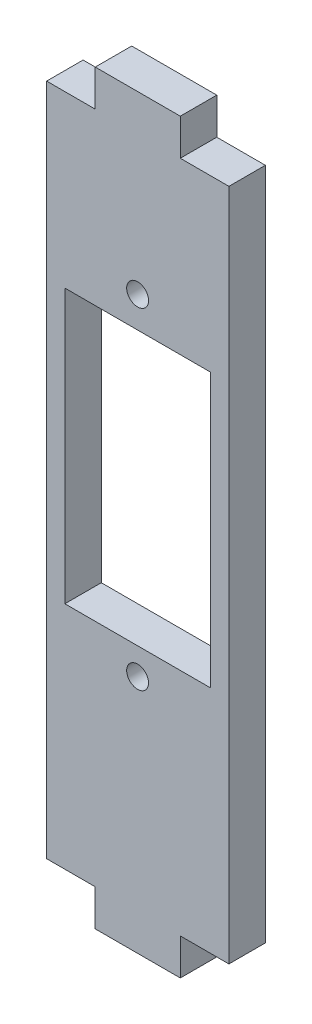
ISO-10303-21;
HEADER;
FILE_DESCRIPTION(('STEP AP214'),'2;1');
FILE_NAME('part.step','',(''),(''),'','','');
FILE_SCHEMA(('AUTOMOTIVE_DESIGN { 1 0 10303 214 1 1 1 1 }'));
ENDSEC;
DATA;
#1=APPLICATION_CONTEXT('core data for automotive mechanical design processes');
#2=APPLICATION_PROTOCOL_DEFINITION('international standard','automotive_design',2000,#1);
#3=PRODUCT_CONTEXT('',#1,'mechanical');
#4=PRODUCT('Part','Part','',(#3));
#5=PRODUCT_RELATED_PRODUCT_CATEGORY('part','',(#4));
#6=PRODUCT_DEFINITION_FORMATION('','',#4);
#7=PRODUCT_DEFINITION_CONTEXT('part definition',#1,'design');
#8=PRODUCT_DEFINITION('design','',#6,#7);
#9=PRODUCT_DEFINITION_SHAPE('','',#8);
#10=(LENGTH_UNIT() NAMED_UNIT(*) SI_UNIT(.MILLI.,.METRE.));
#11=(NAMED_UNIT(*) PLANE_ANGLE_UNIT() SI_UNIT($,.RADIAN.));
#12=(NAMED_UNIT(*) SI_UNIT($,.STERADIAN.) SOLID_ANGLE_UNIT());
#13=UNCERTAINTY_MEASURE_WITH_UNIT(LENGTH_MEASURE(1.E-05),#10,'distance_accuracy_value','');
#14=(GEOMETRIC_REPRESENTATION_CONTEXT(3) GLOBAL_UNCERTAINTY_ASSIGNED_CONTEXT((#13)) GLOBAL_UNIT_ASSIGNED_CONTEXT((#10,
#11,#12)) REPRESENTATION_CONTEXT('',''));
#15=CARTESIAN_POINT('',(0.,0.,0.));
#16=DIRECTION('',(0.,0.,1.));
#17=DIRECTION('',(1.,0.,0.));
#18=AXIS2_PLACEMENT_3D('',#15,#16,#17);
#19=CARTESIAN_POINT('',(0.,0.,3.));
#20=DIRECTION('',(0.,0.,1.));
#21=DIRECTION('',(1.,0.,0.));
#22=AXIS2_PLACEMENT_3D('',#19,#20,#21);
#23=PLANE('',#22);
#24=CARTESIAN_POINT('',(-0.0129135727040056,16.2550295868136,3.));
#25=DIRECTION('',(0.,0.,-1.));
#26=DIRECTION('',(-1.,0.,0.));
#27=AXIS2_PLACEMENT_3D('',#24,#25,#26);
#28=CIRCLE('',#27,0.900000000000001);
#29=CARTESIAN_POINT('',(-0.912913572704006,16.2550295868136,3.));
#30=VERTEX_POINT('',#29);
#31=EDGE_CURVE('E192',#30,#30,#28,.T.);
#32=ORIENTED_EDGE('',*,*,#31,.T.);
#33=EDGE_LOOP('',(#32));
#34=FACE_BOUND('',#33,.T.);
#35=CARTESIAN_POINT('',(-0.0129135727039986,-10.9949704131864,3.));
#36=DIRECTION('',(0.,0.,-1.));
#37=DIRECTION('',(-1.,0.,0.));
#38=AXIS2_PLACEMENT_3D('',#35,#36,#37);
#39=CIRCLE('',#38,0.9);
#40=CARTESIAN_POINT('',(-0.912913572703998,-10.9949704131864,3.));
#41=VERTEX_POINT('',#40);
#42=EDGE_CURVE('E556',#41,#41,#39,.T.);
#43=ORIENTED_EDGE('',*,*,#42,.T.);
#44=EDGE_LOOP('',(#43));
#45=FACE_BOUND('',#44,.T.);
#46=DIRECTION('',(0.,-1.,0.));
#47=VECTOR('',#46,1.);
#48=CARTESIAN_POINT('',(-6.,13.71,3.));
#49=LINE('',#48,#47);
#50=CARTESIAN_POINT('',(-6.,13.71,3.));
#51=VERTEX_POINT('',#50);
#52=CARTESIAN_POINT('',(-6.,-8.79000000000001,3.));
#53=VERTEX_POINT('',#52);
#54=EDGE_CURVE('E57',#51,#53,#49,.T.);
#55=ORIENTED_EDGE('',*,*,#54,.F.);
#56=DIRECTION('',(-1.,0.,0.));
#57=VECTOR('',#56,1.);
#58=CARTESIAN_POINT('',(-6.,13.71,3.));
#59=LINE('',#58,#57);
#60=CARTESIAN_POINT('',(6.,13.71,3.));
#61=VERTEX_POINT('',#60);
#62=EDGE_CURVE('E175',#61,#51,#59,.T.);
#63=ORIENTED_EDGE('',*,*,#62,.F.);
#64=DIRECTION('',(0.,1.,0.));
#65=VECTOR('',#64,1.);
#66=CARTESIAN_POINT('',(6.,13.71,3.));
#67=LINE('',#66,#65);
#68=CARTESIAN_POINT('',(6.,-8.79000000000001,3.));
#69=VERTEX_POINT('',#68);
#70=EDGE_CURVE('E179',#69,#61,#67,.T.);
#71=ORIENTED_EDGE('',*,*,#70,.F.);
#72=DIRECTION('',(1.,0.,0.));
#73=VECTOR('',#72,1.);
#74=CARTESIAN_POINT('',(-6.,-8.79000000000001,3.));
#75=LINE('',#74,#73);
#76=EDGE_CURVE('E191',#53,#69,#75,.T.);
#77=ORIENTED_EDGE('',*,*,#76,.F.);
#78=EDGE_LOOP('',(#55,#63,#71,#77));
#79=FACE_BOUND('',#78,.T.);
#80=DIRECTION('',(0.,-1.,0.));
#81=VECTOR('',#80,1.);
#82=CARTESIAN_POINT('',(-7.50000000000001,30.71,3.));
#83=LINE('',#82,#81);
#84=CARTESIAN_POINT('',(-7.50000000000001,27.71,3.));
#85=VERTEX_POINT('',#84);
#86=CARTESIAN_POINT('',(-7.50000000000001,-27.71,3.));
#87=VERTEX_POINT('',#86);
#88=EDGE_CURVE('E49',#85,#87,#83,.T.);
#89=ORIENTED_EDGE('',*,*,#88,.T.);
#90=DIRECTION('',(1.,0.,0.));
#91=VECTOR('',#90,1.);
#92=CARTESIAN_POINT('',(-7.50000000000001,-27.71,3.));
#93=LINE('',#92,#91);
#94=CARTESIAN_POINT('',(-3.5,-27.71,3.));
#95=VERTEX_POINT('',#94);
#96=EDGE_CURVE('E211',#87,#95,#93,.T.);
#97=ORIENTED_EDGE('',*,*,#96,.T.);
#98=DIRECTION('',(0.,-1.,0.));
#99=VECTOR('',#98,1.);
#100=CARTESIAN_POINT('',(-3.5,-30.71,3.));
#101=LINE('',#100,#99);
#102=CARTESIAN_POINT('',(-3.5,-30.71,3.));
#103=VERTEX_POINT('',#102);
#104=EDGE_CURVE('E201',#95,#103,#101,.T.);
#105=ORIENTED_EDGE('',*,*,#104,.T.);
#106=DIRECTION('',(1.,0.,0.));
#107=VECTOR('',#106,1.);
#108=CARTESIAN_POINT('',(-7.5,-30.71,3.));
#109=LINE('',#108,#107);
#110=CARTESIAN_POINT('',(3.5,-30.71,3.));
#111=VERTEX_POINT('',#110);
#112=EDGE_CURVE('E11',#103,#111,#109,.T.);
#113=ORIENTED_EDGE('',*,*,#112,.T.);
#114=DIRECTION('',(0.,-1.,0.));
#115=VECTOR('',#114,1.);
#116=CARTESIAN_POINT('',(3.5,-30.71,3.));
#117=LINE('',#116,#115);
#118=CARTESIAN_POINT('',(3.5,-27.71,3.));
#119=VERTEX_POINT('',#118);
#120=EDGE_CURVE('E236',#119,#111,#117,.T.);
#121=ORIENTED_EDGE('',*,*,#120,.F.);
#122=DIRECTION('',(-1.,0.,0.));
#123=VECTOR('',#122,1.);
#124=CARTESIAN_POINT('',(7.50000000000001,-27.71,3.));
#125=LINE('',#124,#123);
#126=CARTESIAN_POINT('',(7.50000000000001,-27.71,3.));
#127=VERTEX_POINT('',#126);
#128=EDGE_CURVE('E225',#127,#119,#125,.T.);
#129=ORIENTED_EDGE('',*,*,#128,.F.);
#130=DIRECTION('',(0.,1.,0.));
#131=VECTOR('',#130,1.);
#132=CARTESIAN_POINT('',(7.49999999999999,30.71,3.));
#133=LINE('',#132,#131);
#134=CARTESIAN_POINT('',(7.50000000000001,27.71,3.));
#135=VERTEX_POINT('',#134);
#136=EDGE_CURVE('E308',#127,#135,#133,.T.);
#137=ORIENTED_EDGE('',*,*,#136,.T.);
#138=DIRECTION('',(-1.,0.,0.));
#139=VECTOR('',#138,1.);
#140=CARTESIAN_POINT('',(7.50000000000001,27.71,3.));
#141=LINE('',#140,#139);
#142=CARTESIAN_POINT('',(3.5,27.71,3.));
#143=VERTEX_POINT('',#142);
#144=EDGE_CURVE('E261',#135,#143,#141,.T.);
#145=ORIENTED_EDGE('',*,*,#144,.T.);
#146=DIRECTION('',(0.,1.,0.));
#147=VECTOR('',#146,1.);
#148=CARTESIAN_POINT('',(3.5,30.71,3.));
#149=LINE('',#148,#147);
#150=CARTESIAN_POINT('',(3.5,30.71,3.));
#151=VERTEX_POINT('',#150);
#152=EDGE_CURVE('E251',#143,#151,#149,.T.);
#153=ORIENTED_EDGE('',*,*,#152,.T.);
#154=DIRECTION('',(-1.,0.,0.));
#155=VECTOR('',#154,1.);
#156=CARTESIAN_POINT('',(-7.50000000000001,30.71,3.));
#157=LINE('',#156,#155);
#158=CARTESIAN_POINT('',(-3.5,30.71,3.));
#159=VERTEX_POINT('',#158);
#160=EDGE_CURVE('E311',#151,#159,#157,.T.);
#161=ORIENTED_EDGE('',*,*,#160,.T.);
#162=DIRECTION('',(0.,1.,0.));
#163=VECTOR('',#162,1.);
#164=CARTESIAN_POINT('',(-3.5,30.71,3.));
#165=LINE('',#164,#163);
#166=CARTESIAN_POINT('',(-3.5,27.71,3.));
#167=VERTEX_POINT('',#166);
#168=EDGE_CURVE('E287',#167,#159,#165,.T.);
#169=ORIENTED_EDGE('',*,*,#168,.F.);
#170=DIRECTION('',(1.,0.,0.));
#171=VECTOR('',#170,1.);
#172=CARTESIAN_POINT('',(-7.50000000000001,27.71,3.));
#173=LINE('',#172,#171);
#174=EDGE_CURVE('E276',#85,#167,#173,.T.);
#175=ORIENTED_EDGE('',*,*,#174,.F.);
#176=EDGE_LOOP('',(#89,#97,#105,#113,#121,#129,#137,#145,#153,#161,#169,#175));
#177=FACE_BOUND('',#176,.T.);
#178=ADVANCED_FACE('F39',(#34,#45,#79,#177),#23,.T.);
#179=CARTESIAN_POINT('',(0.,0.,0.));
#180=DIRECTION('',(0.,0.,1.));
#181=DIRECTION('',(1.,0.,0.));
#182=AXIS2_PLACEMENT_3D('',#179,#180,#181);
#183=PLANE('',#182);
#184=CARTESIAN_POINT('',(-0.0129135727040056,16.2550295868136,0.));
#185=DIRECTION('',(0.,0.,-1.));
#186=DIRECTION('',(-1.,0.,0.));
#187=AXIS2_PLACEMENT_3D('',#184,#185,#186);
#188=CIRCLE('',#187,0.900000000000001);
#189=CARTESIAN_POINT('',(-0.912913572704006,16.2550295868136,0.));
#190=VERTEX_POINT('',#189);
#191=EDGE_CURVE('E554',#190,#190,#188,.T.);
#192=ORIENTED_EDGE('',*,*,#191,.F.);
#193=EDGE_LOOP('',(#192));
#194=FACE_BOUND('',#193,.T.);
#195=CARTESIAN_POINT('',(-0.0129135727039986,-10.9949704131864,0.));
#196=DIRECTION('',(0.,0.,-1.));
#197=DIRECTION('',(-1.,0.,0.));
#198=AXIS2_PLACEMENT_3D('',#195,#196,#197);
#199=CIRCLE('',#198,0.9);
#200=CARTESIAN_POINT('',(-0.912913572703998,-10.9949704131864,0.));
#201=VERTEX_POINT('',#200);
#202=EDGE_CURVE('E182',#201,#201,#199,.T.);
#203=ORIENTED_EDGE('',*,*,#202,.F.);
#204=EDGE_LOOP('',(#203));
#205=FACE_BOUND('',#204,.T.);
#206=DIRECTION('',(-1.,0.,0.));
#207=VECTOR('',#206,1.);
#208=CARTESIAN_POINT('',(-6.,13.71,0.));
#209=LINE('',#208,#207);
#210=CARTESIAN_POINT('',(6.,13.71,0.));
#211=VERTEX_POINT('',#210);
#212=CARTESIAN_POINT('',(-6.,13.71,0.));
#213=VERTEX_POINT('',#212);
#214=EDGE_CURVE('E163',#211,#213,#209,.T.);
#215=ORIENTED_EDGE('',*,*,#214,.T.);
#216=DIRECTION('',(0.,-1.,0.));
#217=VECTOR('',#216,1.);
#218=CARTESIAN_POINT('',(-6.,13.71,0.));
#219=LINE('',#218,#217);
#220=CARTESIAN_POINT('',(-6.,-8.79000000000001,0.));
#221=VERTEX_POINT('',#220);
#222=EDGE_CURVE('E156',#213,#221,#219,.T.);
#223=ORIENTED_EDGE('',*,*,#222,.T.);
#224=DIRECTION('',(1.,0.,0.));
#225=VECTOR('',#224,1.);
#226=CARTESIAN_POINT('',(-6.,-8.79000000000001,0.));
#227=LINE('',#226,#225);
#228=CARTESIAN_POINT('',(6.,-8.79000000000001,0.));
#229=VERTEX_POINT('',#228);
#230=EDGE_CURVE('E166',#221,#229,#227,.T.);
#231=ORIENTED_EDGE('',*,*,#230,.T.);
#232=DIRECTION('',(0.,1.,0.));
#233=VECTOR('',#232,1.);
#234=CARTESIAN_POINT('',(6.,13.71,0.));
#235=LINE('',#234,#233);
#236=EDGE_CURVE('E65',#229,#211,#235,.T.);
#237=ORIENTED_EDGE('',*,*,#236,.T.);
#238=EDGE_LOOP('',(#215,#223,#231,#237));
#239=FACE_BOUND('',#238,.T.);
#240=DIRECTION('',(1.,0.,0.));
#241=VECTOR('',#240,1.);
#242=CARTESIAN_POINT('',(-7.50000000000001,-27.71,0.));
#243=LINE('',#242,#241);
#244=CARTESIAN_POINT('',(-7.50000000000001,-27.71,0.));
#245=VERTEX_POINT('',#244);
#246=CARTESIAN_POINT('',(-3.5,-27.71,0.));
#247=VERTEX_POINT('',#246);
#248=EDGE_CURVE('E210',#245,#247,#243,.T.);
#249=ORIENTED_EDGE('',*,*,#248,.F.);
#250=DIRECTION('',(0.,-1.,0.));
#251=VECTOR('',#250,1.);
#252=CARTESIAN_POINT('',(-7.50000000000001,30.71,0.));
#253=LINE('',#252,#251);
#254=CARTESIAN_POINT('',(-7.50000000000001,27.71,0.));
#255=VERTEX_POINT('',#254);
#256=EDGE_CURVE('E321',#255,#245,#253,.T.);
#257=ORIENTED_EDGE('',*,*,#256,.F.);
#258=DIRECTION('',(1.,0.,0.));
#259=VECTOR('',#258,1.);
#260=CARTESIAN_POINT('',(-7.50000000000001,27.71,0.));
#261=LINE('',#260,#259);
#262=CARTESIAN_POINT('',(-3.5,27.71,0.));
#263=VERTEX_POINT('',#262);
#264=EDGE_CURVE('E282',#255,#263,#261,.T.);
#265=ORIENTED_EDGE('',*,*,#264,.T.);
#266=DIRECTION('',(0.,1.,0.));
#267=VECTOR('',#266,1.);
#268=CARTESIAN_POINT('',(-3.5,30.71,0.));
#269=LINE('',#268,#267);
#270=CARTESIAN_POINT('',(-3.5,30.71,0.));
#271=VERTEX_POINT('',#270);
#272=EDGE_CURVE('E286',#263,#271,#269,.T.);
#273=ORIENTED_EDGE('',*,*,#272,.T.);
#274=DIRECTION('',(-1.,0.,0.));
#275=VECTOR('',#274,1.);
#276=CARTESIAN_POINT('',(-7.50000000000001,30.71,0.));
#277=LINE('',#276,#275);
#278=CARTESIAN_POINT('',(3.5,30.71,0.));
#279=VERTEX_POINT('',#278);
#280=EDGE_CURVE('E319',#279,#271,#277,.T.);
#281=ORIENTED_EDGE('',*,*,#280,.F.);
#282=DIRECTION('',(0.,1.,0.));
#283=VECTOR('',#282,1.);
#284=CARTESIAN_POINT('',(3.5,30.71,0.));
#285=LINE('',#284,#283);
#286=CARTESIAN_POINT('',(3.5,27.71,0.));
#287=VERTEX_POINT('',#286);
#288=EDGE_CURVE('E257',#287,#279,#285,.T.);
#289=ORIENTED_EDGE('',*,*,#288,.F.);
#290=DIRECTION('',(-1.,0.,0.));
#291=VECTOR('',#290,1.);
#292=CARTESIAN_POINT('',(7.50000000000001,27.71,0.));
#293=LINE('',#292,#291);
#294=CARTESIAN_POINT('',(7.50000000000001,27.71,0.));
#295=VERTEX_POINT('',#294);
#296=EDGE_CURVE('E260',#295,#287,#293,.T.);
#297=ORIENTED_EDGE('',*,*,#296,.F.);
#298=DIRECTION('',(0.,1.,0.));
#299=VECTOR('',#298,1.);
#300=CARTESIAN_POINT('',(7.49999999999999,30.71,0.));
#301=LINE('',#300,#299);
#302=CARTESIAN_POINT('',(7.50000000000001,-27.71,0.));
#303=VERTEX_POINT('',#302);
#304=EDGE_CURVE('E302',#303,#295,#301,.T.);
#305=ORIENTED_EDGE('',*,*,#304,.F.);
#306=DIRECTION('',(-1.,0.,0.));
#307=VECTOR('',#306,1.);
#308=CARTESIAN_POINT('',(7.50000000000001,-27.71,0.));
#309=LINE('',#308,#307);
#310=CARTESIAN_POINT('',(3.5,-27.71,0.));
#311=VERTEX_POINT('',#310);
#312=EDGE_CURVE('E231',#303,#311,#309,.T.);
#313=ORIENTED_EDGE('',*,*,#312,.T.);
#314=DIRECTION('',(0.,-1.,0.));
#315=VECTOR('',#314,1.);
#316=CARTESIAN_POINT('',(3.5,-30.71,0.));
#317=LINE('',#316,#315);
#318=CARTESIAN_POINT('',(3.5,-30.71,0.));
#319=VERTEX_POINT('',#318);
#320=EDGE_CURVE('E235',#311,#319,#317,.T.);
#321=ORIENTED_EDGE('',*,*,#320,.T.);
#322=DIRECTION('',(1.,0.,0.));
#323=VECTOR('',#322,1.);
#324=CARTESIAN_POINT('',(-7.5,-30.71,0.));
#325=LINE('',#324,#323);
#326=CARTESIAN_POINT('',(-3.5,-30.71,0.));
#327=VERTEX_POINT('',#326);
#328=EDGE_CURVE('E43',#327,#319,#325,.T.);
#329=ORIENTED_EDGE('',*,*,#328,.F.);
#330=DIRECTION('',(0.,-1.,0.));
#331=VECTOR('',#330,1.);
#332=CARTESIAN_POINT('',(-3.5,-30.71,0.));
#333=LINE('',#332,#331);
#334=EDGE_CURVE('E207',#247,#327,#333,.T.);
#335=ORIENTED_EDGE('',*,*,#334,.F.);
#336=EDGE_LOOP('',(#249,#257,#265,#273,#281,#289,#297,#305,#313,#321,#329,#335));
#337=FACE_BOUND('',#336,.T.);
#338=ADVANCED_FACE('F171',(#194,#205,#239,#337),#183,.F.);
#339=CARTESIAN_POINT('',(-7.50000000000001,30.71,3.));
#340=DIRECTION('',(1.,0.,0.));
#341=DIRECTION('',(0.,1.,0.));
#342=AXIS2_PLACEMENT_3D('',#339,#340,#341);
#343=PLANE('',#342);
#344=DIRECTION('',(0.,0.,1.));
#345=VECTOR('',#344,1.);
#346=CARTESIAN_POINT('',(-7.50000000000001,-27.71,0.));
#347=LINE('',#346,#345);
#348=EDGE_CURVE('E221',#245,#87,#347,.T.);
#349=ORIENTED_EDGE('',*,*,#348,.T.);
#350=ORIENTED_EDGE('',*,*,#88,.F.);
#351=DIRECTION('',(0.,0.,1.));
#352=VECTOR('',#351,1.);
#353=CARTESIAN_POINT('',(-7.50000000000001,27.71,0.));
#354=LINE('',#353,#352);
#355=EDGE_CURVE('E291',#255,#85,#354,.T.);
#356=ORIENTED_EDGE('',*,*,#355,.F.);
#357=ORIENTED_EDGE('',*,*,#256,.T.);
#358=EDGE_LOOP('',(#349,#350,#356,#357));
#359=FACE_BOUND('',#358,.T.);
#360=ADVANCED_FACE('F371',(#359),#343,.F.);
#361=CARTESIAN_POINT('',(-7.5,-30.71,3.));
#362=DIRECTION('',(0.,1.,0.));
#363=DIRECTION('',(0.,0.,1.));
#364=AXIS2_PLACEMENT_3D('',#361,#362,#363);
#365=PLANE('',#364);
#366=DIRECTION('',(0.,0.,1.));
#367=VECTOR('',#366,1.);
#368=CARTESIAN_POINT('',(-3.5,-30.71,0.));
#369=LINE('',#368,#367);
#370=EDGE_CURVE('E214',#327,#103,#369,.T.);
#371=ORIENTED_EDGE('',*,*,#370,.F.);
#372=ORIENTED_EDGE('',*,*,#328,.T.);
#373=DIRECTION('',(0.,0.,1.));
#374=VECTOR('',#373,1.);
#375=CARTESIAN_POINT('',(3.5,-30.71,0.));
#376=LINE('',#375,#374);
#377=EDGE_CURVE('E247',#319,#111,#376,.T.);
#378=ORIENTED_EDGE('',*,*,#377,.T.);
#379=ORIENTED_EDGE('',*,*,#112,.F.);
#380=EDGE_LOOP('',(#371,#372,#378,#379));
#381=FACE_BOUND('',#380,.T.);
#382=ADVANCED_FACE('F332',(#381),#365,.F.);
#383=CARTESIAN_POINT('',(7.49999999999999,30.71,3.));
#384=DIRECTION('',(-1.,0.,0.));
#385=DIRECTION('',(0.,-1.,0.));
#386=AXIS2_PLACEMENT_3D('',#383,#384,#385);
#387=PLANE('',#386);
#388=ORIENTED_EDGE('',*,*,#136,.F.);
#389=DIRECTION('',(0.,0.,1.));
#390=VECTOR('',#389,1.);
#391=CARTESIAN_POINT('',(7.50000000000001,-27.71,0.));
#392=LINE('',#391,#390);
#393=EDGE_CURVE('E240',#303,#127,#392,.T.);
#394=ORIENTED_EDGE('',*,*,#393,.F.);
#395=ORIENTED_EDGE('',*,*,#304,.T.);
#396=DIRECTION('',(0.,0.,1.));
#397=VECTOR('',#396,1.);
#398=CARTESIAN_POINT('',(7.50000000000001,27.71,0.));
#399=LINE('',#398,#397);
#400=EDGE_CURVE('E272',#295,#135,#399,.T.);
#401=ORIENTED_EDGE('',*,*,#400,.T.);
#402=EDGE_LOOP('',(#388,#394,#395,#401));
#403=FACE_BOUND('',#402,.T.);
#404=ADVANCED_FACE('F41',(#403),#387,.F.);
#405=CARTESIAN_POINT('',(-7.50000000000001,30.71,3.));
#406=DIRECTION('',(0.,-1.,0.));
#407=DIRECTION('',(0.,0.,-1.));
#408=AXIS2_PLACEMENT_3D('',#405,#406,#407);
#409=PLANE('',#408);
#410=DIRECTION('',(0.,0.,1.));
#411=VECTOR('',#410,1.);
#412=CARTESIAN_POINT('',(3.5,30.71,0.));
#413=LINE('',#412,#411);
#414=EDGE_CURVE('E265',#279,#151,#413,.T.);
#415=ORIENTED_EDGE('',*,*,#414,.F.);
#416=ORIENTED_EDGE('',*,*,#280,.T.);
#417=DIRECTION('',(0.,0.,1.));
#418=VECTOR('',#417,1.);
#419=CARTESIAN_POINT('',(-3.5,30.71,0.));
#420=LINE('',#419,#418);
#421=EDGE_CURVE('E298',#271,#159,#420,.T.);
#422=ORIENTED_EDGE('',*,*,#421,.T.);
#423=ORIENTED_EDGE('',*,*,#160,.F.);
#424=EDGE_LOOP('',(#415,#416,#422,#423));
#425=FACE_BOUND('',#424,.T.);
#426=ADVANCED_FACE('F361',(#425),#409,.F.);
#427=CARTESIAN_POINT('',(-3.5,30.71,0.));
#428=DIRECTION('',(1.,0.,0.));
#429=DIRECTION('',(0.,1.,0.));
#430=AXIS2_PLACEMENT_3D('',#427,#428,#429);
#431=PLANE('',#430);
#432=ORIENTED_EDGE('',*,*,#168,.T.);
#433=ORIENTED_EDGE('',*,*,#421,.F.);
#434=ORIENTED_EDGE('',*,*,#272,.F.);
#435=DIRECTION('',(0.,0.,1.));
#436=VECTOR('',#435,1.);
#437=CARTESIAN_POINT('',(-3.5,27.71,0.));
#438=LINE('',#437,#436);
#439=EDGE_CURVE('E303',#263,#167,#438,.T.);
#440=ORIENTED_EDGE('',*,*,#439,.T.);
#441=EDGE_LOOP('',(#432,#433,#434,#440));
#442=FACE_BOUND('',#441,.T.);
#443=ADVANCED_FACE('F365',(#442),#431,.F.);
#444=CARTESIAN_POINT('',(-7.50000000000001,27.71,0.));
#445=DIRECTION('',(0.,-1.,0.));
#446=DIRECTION('',(0.,0.,-1.));
#447=AXIS2_PLACEMENT_3D('',#444,#445,#446);
#448=PLANE('',#447);
#449=ORIENTED_EDGE('',*,*,#174,.T.);
#450=ORIENTED_EDGE('',*,*,#439,.F.);
#451=ORIENTED_EDGE('',*,*,#264,.F.);
#452=ORIENTED_EDGE('',*,*,#355,.T.);
#453=EDGE_LOOP('',(#449,#450,#451,#452));
#454=FACE_BOUND('',#453,.T.);
#455=ADVANCED_FACE('F368',(#454),#448,.F.);
#456=CARTESIAN_POINT('',(7.50000000000001,27.71,0.));
#457=DIRECTION('',(0.,1.,0.));
#458=DIRECTION('',(0.,0.,1.));
#459=AXIS2_PLACEMENT_3D('',#456,#457,#458);
#460=PLANE('',#459);
#461=ORIENTED_EDGE('',*,*,#144,.F.);
#462=ORIENTED_EDGE('',*,*,#400,.F.);
#463=ORIENTED_EDGE('',*,*,#296,.T.);
#464=DIRECTION('',(0.,0.,1.));
#465=VECTOR('',#464,1.);
#466=CARTESIAN_POINT('',(3.5,27.71,0.));
#467=LINE('',#466,#465);
#468=EDGE_CURVE('E277',#287,#143,#467,.T.);
#469=ORIENTED_EDGE('',*,*,#468,.T.);
#470=EDGE_LOOP('',(#461,#462,#463,#469));
#471=FACE_BOUND('',#470,.T.);
#472=ADVANCED_FACE('F352',(#471),#460,.T.);
#473=CARTESIAN_POINT('',(3.5,30.71,0.));
#474=DIRECTION('',(1.,0.,0.));
#475=DIRECTION('',(0.,1.,0.));
#476=AXIS2_PLACEMENT_3D('',#473,#474,#475);
#477=PLANE('',#476);
#478=ORIENTED_EDGE('',*,*,#152,.F.);
#479=ORIENTED_EDGE('',*,*,#468,.F.);
#480=ORIENTED_EDGE('',*,*,#288,.T.);
#481=ORIENTED_EDGE('',*,*,#414,.T.);
#482=EDGE_LOOP('',(#478,#479,#480,#481));
#483=FACE_BOUND('',#482,.T.);
#484=ADVANCED_FACE('F356',(#483),#477,.T.);
#485=CARTESIAN_POINT('',(3.5,-30.71,0.));
#486=DIRECTION('',(-1.,0.,0.));
#487=DIRECTION('',(0.,-1.,0.));
#488=AXIS2_PLACEMENT_3D('',#485,#486,#487);
#489=PLANE('',#488);
#490=ORIENTED_EDGE('',*,*,#120,.T.);
#491=ORIENTED_EDGE('',*,*,#377,.F.);
#492=ORIENTED_EDGE('',*,*,#320,.F.);
#493=DIRECTION('',(0.,0.,1.));
#494=VECTOR('',#493,1.);
#495=CARTESIAN_POINT('',(3.5,-27.71,0.));
#496=LINE('',#495,#494);
#497=EDGE_CURVE('E252',#311,#119,#496,.T.);
#498=ORIENTED_EDGE('',*,*,#497,.T.);
#499=EDGE_LOOP('',(#490,#491,#492,#498));
#500=FACE_BOUND('',#499,.T.);
#501=ADVANCED_FACE('F337',(#500),#489,.F.);
#502=CARTESIAN_POINT('',(7.50000000000001,-27.71,0.));
#503=DIRECTION('',(0.,1.,0.));
#504=DIRECTION('',(0.,0.,1.));
#505=AXIS2_PLACEMENT_3D('',#502,#503,#504);
#506=PLANE('',#505);
#507=ORIENTED_EDGE('',*,*,#128,.T.);
#508=ORIENTED_EDGE('',*,*,#497,.F.);
#509=ORIENTED_EDGE('',*,*,#312,.F.);
#510=ORIENTED_EDGE('',*,*,#393,.T.);
#511=EDGE_LOOP('',(#507,#508,#509,#510));
#512=FACE_BOUND('',#511,.T.);
#513=ADVANCED_FACE('F344',(#512),#506,.F.);
#514=CARTESIAN_POINT('',(-7.50000000000001,-27.71,0.));
#515=DIRECTION('',(0.,-1.,0.));
#516=DIRECTION('',(0.,0.,-1.));
#517=AXIS2_PLACEMENT_3D('',#514,#515,#516);
#518=PLANE('',#517);
#519=ORIENTED_EDGE('',*,*,#96,.F.);
#520=ORIENTED_EDGE('',*,*,#348,.F.);
#521=ORIENTED_EDGE('',*,*,#248,.T.);
#522=DIRECTION('',(0.,0.,1.));
#523=VECTOR('',#522,1.);
#524=CARTESIAN_POINT('',(-3.5,-27.71,0.));
#525=LINE('',#524,#523);
#526=EDGE_CURVE('E226',#247,#95,#525,.T.);
#527=ORIENTED_EDGE('',*,*,#526,.T.);
#528=EDGE_LOOP('',(#519,#520,#521,#527));
#529=FACE_BOUND('',#528,.T.);
#530=ADVANCED_FACE('F374',(#529),#518,.T.);
#531=CARTESIAN_POINT('',(-3.5,-30.71,0.));
#532=DIRECTION('',(-1.,0.,0.));
#533=DIRECTION('',(0.,-1.,0.));
#534=AXIS2_PLACEMENT_3D('',#531,#532,#533);
#535=PLANE('',#534);
#536=ORIENTED_EDGE('',*,*,#104,.F.);
#537=ORIENTED_EDGE('',*,*,#526,.F.);
#538=ORIENTED_EDGE('',*,*,#334,.T.);
#539=ORIENTED_EDGE('',*,*,#370,.T.);
#540=EDGE_LOOP('',(#536,#537,#538,#539));
#541=FACE_BOUND('',#540,.T.);
#542=ADVANCED_FACE('F377',(#541),#535,.T.);
#543=CARTESIAN_POINT('',(-6.,13.71,0.));
#544=DIRECTION('',(-1.,0.,0.));
#545=DIRECTION('',(0.,-1.,0.));
#546=AXIS2_PLACEMENT_3D('',#543,#544,#545);
#547=PLANE('',#546);
#548=ORIENTED_EDGE('',*,*,#54,.T.);
#549=DIRECTION('',(0.,0.,1.));
#550=VECTOR('',#549,1.);
#551=CARTESIAN_POINT('',(-6.,-8.79000000000001,0.));
#552=LINE('',#551,#550);
#553=EDGE_CURVE('E152',#221,#53,#552,.T.);
#554=ORIENTED_EDGE('',*,*,#553,.F.);
#555=ORIENTED_EDGE('',*,*,#222,.F.);
#556=DIRECTION('',(0.,0.,1.));
#557=VECTOR('',#556,1.);
#558=CARTESIAN_POINT('',(-6.,13.71,0.));
#559=LINE('',#558,#557);
#560=EDGE_CURVE('E198',#213,#51,#559,.T.);
#561=ORIENTED_EDGE('',*,*,#560,.T.);
#562=EDGE_LOOP('',(#548,#554,#555,#561));
#563=FACE_BOUND('',#562,.T.);
#564=ADVANCED_FACE('F154',(#563),#547,.F.);
#565=CARTESIAN_POINT('',(-6.,13.71,0.));
#566=DIRECTION('',(0.,1.,0.));
#567=DIRECTION('',(0.,0.,1.));
#568=AXIS2_PLACEMENT_3D('',#565,#566,#567);
#569=PLANE('',#568);
#570=ORIENTED_EDGE('',*,*,#62,.T.);
#571=ORIENTED_EDGE('',*,*,#560,.F.);
#572=ORIENTED_EDGE('',*,*,#214,.F.);
#573=DIRECTION('',(0.,0.,1.));
#574=VECTOR('',#573,1.);
#575=CARTESIAN_POINT('',(6.,13.71,0.));
#576=LINE('',#575,#574);
#577=EDGE_CURVE('E202',#211,#61,#576,.T.);
#578=ORIENTED_EDGE('',*,*,#577,.T.);
#579=EDGE_LOOP('',(#570,#571,#572,#578));
#580=FACE_BOUND('',#579,.T.);
#581=ADVANCED_FACE('F384',(#580),#569,.F.);
#582=CARTESIAN_POINT('',(6.,13.71,0.));
#583=DIRECTION('',(1.,0.,0.));
#584=DIRECTION('',(0.,1.,0.));
#585=AXIS2_PLACEMENT_3D('',#582,#583,#584);
#586=PLANE('',#585);
#587=ORIENTED_EDGE('',*,*,#70,.T.);
#588=ORIENTED_EDGE('',*,*,#577,.F.);
#589=ORIENTED_EDGE('',*,*,#236,.F.);
#590=DIRECTION('',(0.,0.,1.));
#591=VECTOR('',#590,1.);
#592=CARTESIAN_POINT('',(6.,-8.79000000000001,0.));
#593=LINE('',#592,#591);
#594=EDGE_CURVE('E162',#229,#69,#593,.T.);
#595=ORIENTED_EDGE('',*,*,#594,.T.);
#596=EDGE_LOOP('',(#587,#588,#589,#595));
#597=FACE_BOUND('',#596,.T.);
#598=ADVANCED_FACE('F459',(#597),#586,.F.);
#599=CARTESIAN_POINT('',(-6.,-8.79000000000001,0.));
#600=DIRECTION('',(0.,-1.,0.));
#601=DIRECTION('',(0.,0.,-1.));
#602=AXIS2_PLACEMENT_3D('',#599,#600,#601);
#603=PLANE('',#602);
#604=ORIENTED_EDGE('',*,*,#76,.T.);
#605=ORIENTED_EDGE('',*,*,#594,.F.);
#606=ORIENTED_EDGE('',*,*,#230,.F.);
#607=ORIENTED_EDGE('',*,*,#553,.T.);
#608=EDGE_LOOP('',(#604,#605,#606,#607));
#609=FACE_BOUND('',#608,.T.);
#610=ADVANCED_FACE('F167',(#609),#603,.F.);
#611=CARTESIAN_POINT('',(-0.0129135727039986,-10.9949704131864,3.));
#612=DIRECTION('',(0.,0.,-1.));
#613=DIRECTION('',(-1.,0.,0.));
#614=AXIS2_PLACEMENT_3D('',#611,#612,#613);
#615=CYLINDRICAL_SURFACE('',#614,0.9);
#616=ORIENTED_EDGE('',*,*,#42,.F.);
#617=EDGE_LOOP('',(#616));
#618=FACE_BOUND('',#617,.T.);
#619=ORIENTED_EDGE('',*,*,#202,.T.);
#620=EDGE_LOOP('',(#619));
#621=FACE_BOUND('',#620,.T.);
#622=ADVANCED_FACE('F433',(#618,#621),#615,.F.);
#623=CARTESIAN_POINT('',(-0.0129135727040056,16.2550295868136,3.));
#624=DIRECTION('',(0.,0.,-1.));
#625=DIRECTION('',(-1.,0.,0.));
#626=AXIS2_PLACEMENT_3D('',#623,#624,#625);
#627=CYLINDRICAL_SURFACE('',#626,0.900000000000001);
#628=ORIENTED_EDGE('',*,*,#31,.F.);
#629=EDGE_LOOP('',(#628));
#630=FACE_BOUND('',#629,.T.);
#631=ORIENTED_EDGE('',*,*,#191,.T.);
#632=EDGE_LOOP('',(#631));
#633=FACE_BOUND('',#632,.T.);
#634=ADVANCED_FACE('F438',(#630,#633),#627,.F.);
#635=CLOSED_SHELL('',(#178,#338,#360,#382,#404,#426,#443,#455,#472,#484,#501,#513,#530,#542,
#564,#581,#598,#610,#622,#634));
#636=MANIFOLD_SOLID_BREP('B2',#635);
#637=ADVANCED_BREP_SHAPE_REPRESENTATION('',(#18,#636),#14);
#638=SHAPE_DEFINITION_REPRESENTATION(#9,#637);
ENDSEC;
END-ISO-10303-21;
